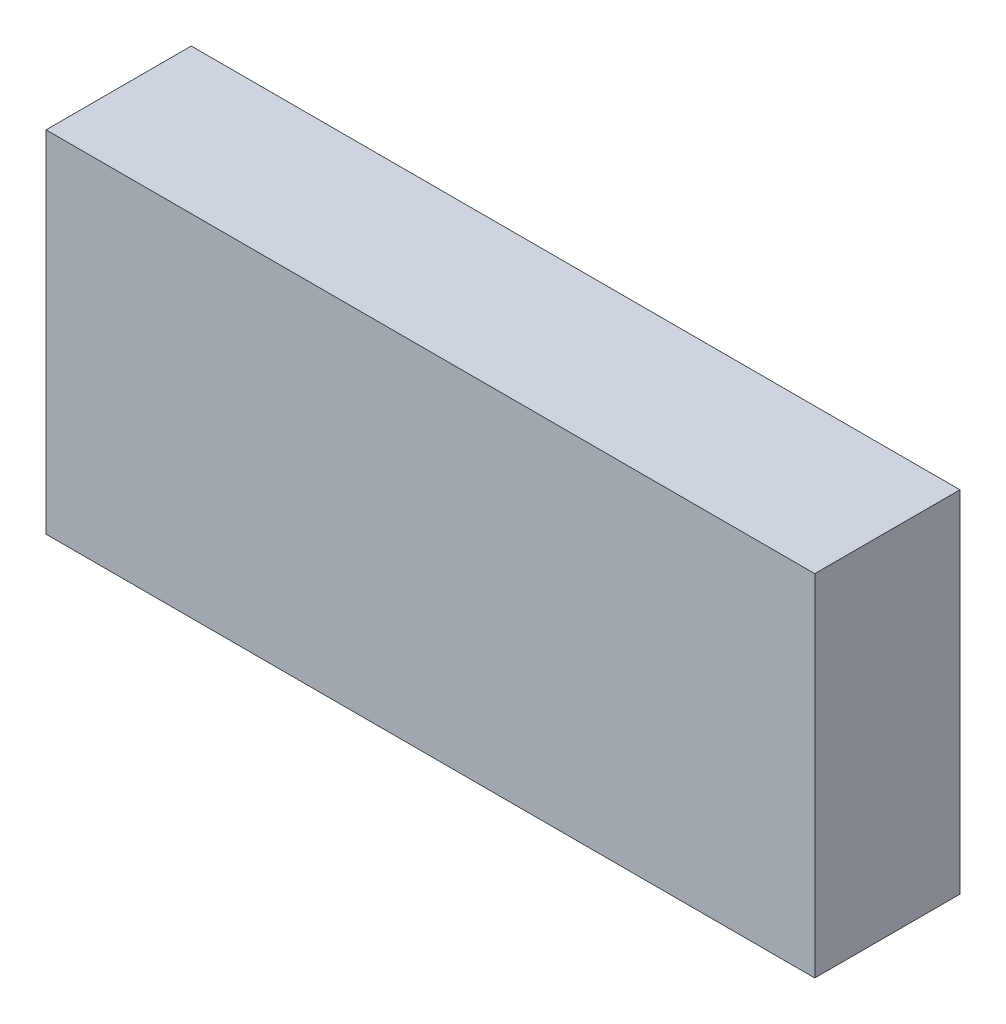
ISO-10303-21;
HEADER;
FILE_DESCRIPTION(('STEP AP214'),'2;1');
FILE_NAME('part.step','',(''),(''),'','','');
FILE_SCHEMA(('AUTOMOTIVE_DESIGN { 1 0 10303 214 1 1 1 1 }'));
ENDSEC;
DATA;
#1=APPLICATION_CONTEXT('core data for automotive mechanical design processes');
#2=APPLICATION_PROTOCOL_DEFINITION('international standard','automotive_design',2000,#1);
#3=PRODUCT_CONTEXT('',#1,'mechanical');
#4=PRODUCT('Part','Part','',(#3));
#5=PRODUCT_RELATED_PRODUCT_CATEGORY('part','',(#4));
#6=PRODUCT_DEFINITION_FORMATION('','',#4);
#7=PRODUCT_DEFINITION_CONTEXT('part definition',#1,'design');
#8=PRODUCT_DEFINITION('design','',#6,#7);
#9=PRODUCT_DEFINITION_SHAPE('','',#8);
#10=(LENGTH_UNIT() NAMED_UNIT(*) SI_UNIT(.MILLI.,.METRE.));
#11=(NAMED_UNIT(*) PLANE_ANGLE_UNIT() SI_UNIT($,.RADIAN.));
#12=(NAMED_UNIT(*) SI_UNIT($,.STERADIAN.) SOLID_ANGLE_UNIT());
#13=UNCERTAINTY_MEASURE_WITH_UNIT(LENGTH_MEASURE(1.E-05),#10,'distance_accuracy_value','');
#14=(GEOMETRIC_REPRESENTATION_CONTEXT(3) GLOBAL_UNCERTAINTY_ASSIGNED_CONTEXT((#13)) GLOBAL_UNIT_ASSIGNED_CONTEXT((#10,
#11,#12)) REPRESENTATION_CONTEXT('',''));
#15=CARTESIAN_POINT('',(0.,0.,0.));
#16=DIRECTION('',(0.,0.,1.));
#17=DIRECTION('',(1.,0.,0.));
#18=AXIS2_PLACEMENT_3D('',#15,#16,#17);
#19=CARTESIAN_POINT('',(-0.0762,-0.5207,0.4572));
#20=DIRECTION('',(0.,0.,1.));
#21=DIRECTION('',(1.,0.,0.));
#22=AXIS2_PLACEMENT_3D('',#19,#20,#21);
#23=PLANE('',#22);
#24=DIRECTION('',(0.,1.,0.));
#25=VECTOR('',#24,1.);
#26=CARTESIAN_POINT('',(2.2098,-0.5207,0.4572));
#27=LINE('',#26,#25);
#28=CARTESIAN_POINT('',(2.2098,0.5207,0.4572));
#29=VERTEX_POINT('',#28);
#30=CARTESIAN_POINT('',(2.2098,-0.5207,0.4572));
#31=VERTEX_POINT('',#30);
#32=EDGE_CURVE('E75',#29,#31,#27,.F.);
#33=ORIENTED_EDGE('',*,*,#32,.F.);
#34=DIRECTION('',(1.,0.,0.));
#35=VECTOR('',#34,1.);
#36=CARTESIAN_POINT('',(-0.0762,0.5207,0.4572));
#37=LINE('',#36,#35);
#38=CARTESIAN_POINT('',(-0.0762,0.5207,0.4572));
#39=VERTEX_POINT('',#38);
#40=EDGE_CURVE('E57',#39,#29,#37,.T.);
#41=ORIENTED_EDGE('',*,*,#40,.F.);
#42=DIRECTION('',(0.,1.,0.));
#43=VECTOR('',#42,1.);
#44=CARTESIAN_POINT('',(-0.0762,-0.5207,0.4572));
#45=LINE('',#44,#43);
#46=CARTESIAN_POINT('',(-0.0762,-0.5207,0.4572));
#47=VERTEX_POINT('',#46);
#48=EDGE_CURVE('E19',#39,#47,#45,.F.);
#49=ORIENTED_EDGE('',*,*,#48,.T.);
#50=DIRECTION('',(1.,0.,0.));
#51=VECTOR('',#50,1.);
#52=CARTESIAN_POINT('',(-0.0762,-0.5207,0.4572));
#53=LINE('',#52,#51);
#54=EDGE_CURVE('E54',#47,#31,#53,.T.);
#55=ORIENTED_EDGE('',*,*,#54,.T.);
#56=EDGE_LOOP('',(#33,#41,#49,#55));
#57=FACE_BOUND('',#56,.T.);
#58=ADVANCED_FACE('F16',(#57),#23,.T.);
#59=CARTESIAN_POINT('',(-0.0762,-0.5207,0.0254));
#60=DIRECTION('',(1.,0.,0.));
#61=DIRECTION('',(0.,0.,-1.));
#62=AXIS2_PLACEMENT_3D('',#59,#60,#61);
#63=PLANE('',#62);
#64=DIRECTION('',(0.,0.,1.));
#65=VECTOR('',#64,1.);
#66=CARTESIAN_POINT('',(-0.0762,0.5207,0.0254));
#67=LINE('',#66,#65);
#68=CARTESIAN_POINT('',(-0.0762,0.5207,0.0254));
#69=VERTEX_POINT('',#68);
#70=EDGE_CURVE('E77',#69,#39,#67,.T.);
#71=ORIENTED_EDGE('',*,*,#70,.F.);
#72=DIRECTION('',(0.,1.,0.));
#73=VECTOR('',#72,1.);
#74=CARTESIAN_POINT('',(-0.0762,-0.5207,0.0254));
#75=LINE('',#74,#73);
#76=CARTESIAN_POINT('',(-0.0762,-0.5207,0.0254));
#77=VERTEX_POINT('',#76);
#78=EDGE_CURVE('E72',#69,#77,#75,.F.);
#79=ORIENTED_EDGE('',*,*,#78,.T.);
#80=DIRECTION('',(0.,0.,1.));
#81=VECTOR('',#80,1.);
#82=CARTESIAN_POINT('',(-0.0762,-0.5207,0.0254));
#83=LINE('',#82,#81);
#84=EDGE_CURVE('E62',#77,#47,#83,.T.);
#85=ORIENTED_EDGE('',*,*,#84,.T.);
#86=ORIENTED_EDGE('',*,*,#48,.F.);
#87=EDGE_LOOP('',(#71,#79,#85,#86));
#88=FACE_BOUND('',#87,.T.);
#89=ADVANCED_FACE('F71',(#88),#63,.F.);
#90=CARTESIAN_POINT('',(-0.0762,-0.5207,0.0254));
#91=DIRECTION('',(0.,1.,0.));
#92=DIRECTION('',(0.,0.,1.));
#93=AXIS2_PLACEMENT_3D('',#90,#91,#92);
#94=PLANE('',#93);
#95=ORIENTED_EDGE('',*,*,#54,.F.);
#96=ORIENTED_EDGE('',*,*,#84,.F.);
#97=DIRECTION('',(1.,0.,0.));
#98=VECTOR('',#97,1.);
#99=CARTESIAN_POINT('',(-0.0762,-0.5207,0.0254));
#100=LINE('',#99,#98);
#101=CARTESIAN_POINT('',(2.2098,-0.5207,0.0254));
#102=VERTEX_POINT('',#101);
#103=EDGE_CURVE('E82',#77,#102,#100,.T.);
#104=ORIENTED_EDGE('',*,*,#103,.T.);
#105=DIRECTION('',(0.,0.,-1.));
#106=VECTOR('',#105,1.);
#107=CARTESIAN_POINT('',(2.2098,-0.5207,0.0254));
#108=LINE('',#107,#106);
#109=EDGE_CURVE('E68',#31,#102,#108,.T.);
#110=ORIENTED_EDGE('',*,*,#109,.F.);
#111=EDGE_LOOP('',(#95,#96,#104,#110));
#112=FACE_BOUND('',#111,.T.);
#113=ADVANCED_FACE('F65',(#112),#94,.F.);
#114=CARTESIAN_POINT('',(2.2098,-0.5207,0.0254));
#115=DIRECTION('',(1.,0.,0.));
#116=DIRECTION('',(0.,0.,-1.));
#117=AXIS2_PLACEMENT_3D('',#114,#115,#116);
#118=PLANE('',#117);
#119=DIRECTION('',(0.,0.,1.));
#120=VECTOR('',#119,1.);
#121=CARTESIAN_POINT('',(2.2098,0.5207,0.0254));
#122=LINE('',#121,#120);
#123=CARTESIAN_POINT('',(2.2098,0.5207,0.0254));
#124=VERTEX_POINT('',#123);
#125=EDGE_CURVE('E33',#29,#124,#122,.F.);
#126=ORIENTED_EDGE('',*,*,#125,.F.);
#127=ORIENTED_EDGE('',*,*,#32,.T.);
#128=ORIENTED_EDGE('',*,*,#109,.T.);
#129=DIRECTION('',(0.,1.,0.));
#130=VECTOR('',#129,1.);
#131=CARTESIAN_POINT('',(2.2098,-0.5207,0.0254));
#132=LINE('',#131,#130);
#133=EDGE_CURVE('E25',#102,#124,#132,.T.);
#134=ORIENTED_EDGE('',*,*,#133,.T.);
#135=EDGE_LOOP('',(#126,#127,#128,#134));
#136=FACE_BOUND('',#135,.T.);
#137=ADVANCED_FACE('F87',(#136),#118,.T.);
#138=CARTESIAN_POINT('',(-0.0762,0.5207,0.0254));
#139=DIRECTION('',(0.,1.,0.));
#140=DIRECTION('',(0.,0.,1.));
#141=AXIS2_PLACEMENT_3D('',#138,#139,#140);
#142=PLANE('',#141);
#143=ORIENTED_EDGE('',*,*,#40,.T.);
#144=ORIENTED_EDGE('',*,*,#125,.T.);
#145=DIRECTION('',(1.,0.,0.));
#146=VECTOR('',#145,1.);
#147=CARTESIAN_POINT('',(-0.0762,0.5207,0.0254));
#148=LINE('',#147,#146);
#149=EDGE_CURVE('E11',#124,#69,#148,.F.);
#150=ORIENTED_EDGE('',*,*,#149,.T.);
#151=ORIENTED_EDGE('',*,*,#70,.T.);
#152=EDGE_LOOP('',(#143,#144,#150,#151));
#153=FACE_BOUND('',#152,.T.);
#154=ADVANCED_FACE('F90',(#153),#142,.T.);
#155=CARTESIAN_POINT('',(-0.0762,-0.5207,0.0254));
#156=DIRECTION('',(0.,0.,1.));
#157=DIRECTION('',(1.,0.,0.));
#158=AXIS2_PLACEMENT_3D('',#155,#156,#157);
#159=PLANE('',#158);
#160=ORIENTED_EDGE('',*,*,#133,.F.);
#161=ORIENTED_EDGE('',*,*,#103,.F.);
#162=ORIENTED_EDGE('',*,*,#78,.F.);
#163=ORIENTED_EDGE('',*,*,#149,.F.);
#164=EDGE_LOOP('',(#160,#161,#162,#163));
#165=FACE_BOUND('',#164,.T.);
#166=ADVANCED_FACE('F89',(#165),#159,.F.);
#167=CLOSED_SHELL('',(#58,#89,#113,#137,#154,#166));
#168=MANIFOLD_SOLID_BREP('B1',#167);
#169=ADVANCED_BREP_SHAPE_REPRESENTATION('',(#18,#168),#14);
#170=SHAPE_DEFINITION_REPRESENTATION(#9,#169);
ENDSEC;
END-ISO-10303-21;
